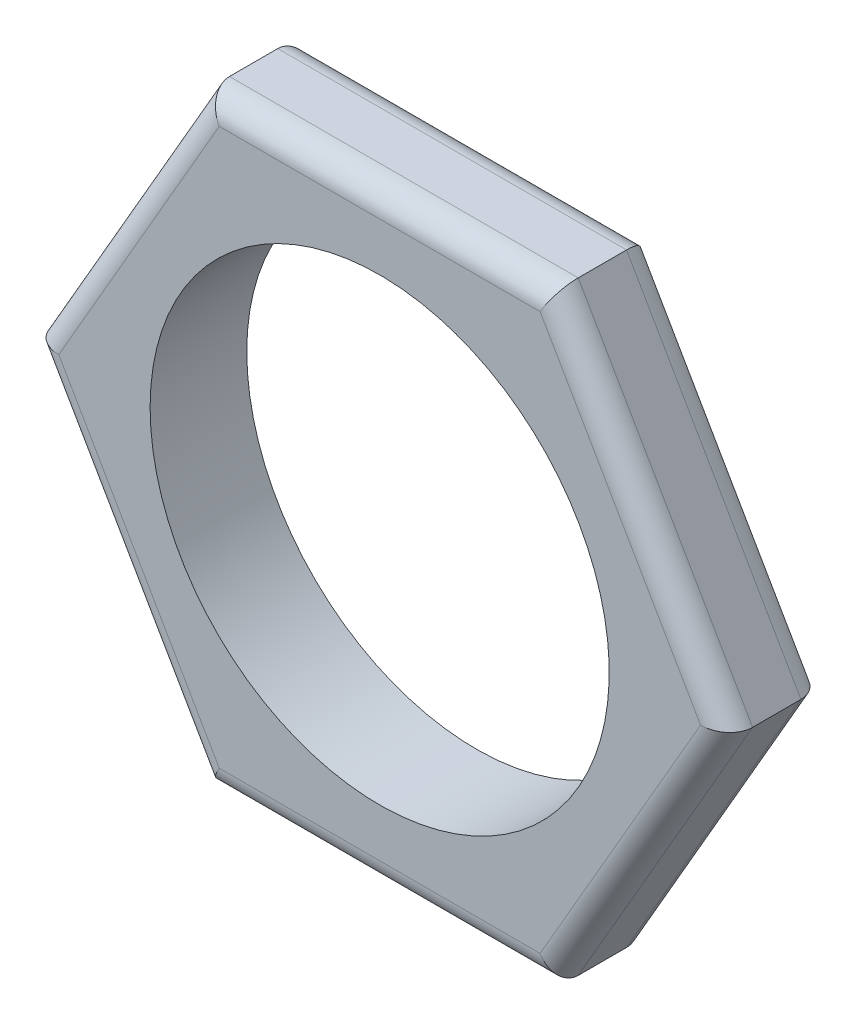
ISO-10303-21;
HEADER;
FILE_DESCRIPTION(('STEP AP214'),'2;1');
FILE_NAME('part.step','',(''),(''),'','','');
FILE_SCHEMA(('AUTOMOTIVE_DESIGN { 1 0 10303 214 1 1 1 1 }'));
ENDSEC;
DATA;
#1=APPLICATION_CONTEXT('core data for automotive mechanical design processes');
#2=APPLICATION_PROTOCOL_DEFINITION('international standard','automotive_design',2000,#1);
#3=PRODUCT_CONTEXT('',#1,'mechanical');
#4=PRODUCT('Part','Part','',(#3));
#5=PRODUCT_RELATED_PRODUCT_CATEGORY('part','',(#4));
#6=PRODUCT_DEFINITION_FORMATION('','',#4);
#7=PRODUCT_DEFINITION_CONTEXT('part definition',#1,'design');
#8=PRODUCT_DEFINITION('design','',#6,#7);
#9=PRODUCT_DEFINITION_SHAPE('','',#8);
#10=(LENGTH_UNIT() NAMED_UNIT(*) SI_UNIT(.MILLI.,.METRE.));
#11=(NAMED_UNIT(*) PLANE_ANGLE_UNIT() SI_UNIT($,.RADIAN.));
#12=(NAMED_UNIT(*) SI_UNIT($,.STERADIAN.) SOLID_ANGLE_UNIT());
#13=UNCERTAINTY_MEASURE_WITH_UNIT(LENGTH_MEASURE(1.E-05),#10,'distance_accuracy_value','');
#14=(GEOMETRIC_REPRESENTATION_CONTEXT(3) GLOBAL_UNCERTAINTY_ASSIGNED_CONTEXT((#13)) GLOBAL_UNIT_ASSIGNED_CONTEXT((#10,
#11,#12)) REPRESENTATION_CONTEXT('',''));
#15=CARTESIAN_POINT('',(0.,0.,0.));
#16=DIRECTION('',(0.,0.,1.));
#17=DIRECTION('',(1.,0.,0.));
#18=AXIS2_PLACEMENT_3D('',#15,#16,#17);
#19=CARTESIAN_POINT('',(-8.61550939198223,0.317499999999979,-0.635));
#20=DIRECTION('',(0.500000000000001,-0.866025403784438,0.));
#21=DIRECTION('',(0.866025403784438,0.500000000000001,0.));
#22=AXIS2_PLACEMENT_3D('',#19,#20,#21);
#23=CYLINDRICAL_SURFACE('',#22,0.635);
#24=CARTESIAN_POINT('',(-8.43220068151452,0.,-0.635));
#25=DIRECTION('',(0.,-1.,0.));
#26=DIRECTION('',(-1.,0.,0.));
#27=AXIS2_PLACEMENT_3D('',#24,#25,#26);
#28=ELLIPSE('',#27,0.733234841870825,0.635);
#29=CARTESIAN_POINT('',(-8.43220068151453,0.,-1.27));
#30=VERTEX_POINT('',#29);
#31=CARTESIAN_POINT('',(-9.16543552338535,0.,-0.635000000000001));
#32=VERTEX_POINT('',#31);
#33=EDGE_CURVE('E181',#30,#32,#28,.F.);
#34=ORIENTED_EDGE('',*,*,#33,.F.);
#35=DIRECTION('',(0.500000000000001,-0.866025403784438,0.));
#36=VECTOR('',#35,1.);
#37=CARTESIAN_POINT('',(-8.43220068151452,0.,-1.27));
#38=LINE('',#37,#36);
#39=CARTESIAN_POINT('',(-4.21610034075726,-7.30250000000004,-1.27));
#40=VERTEX_POINT('',#39);
#41=EDGE_CURVE('E109',#30,#40,#38,.T.);
#42=ORIENTED_EDGE('',*,*,#41,.T.);
#43=CARTESIAN_POINT('',(-4.21610034075726,-7.30250000000004,-0.635));
#44=DIRECTION('',(0.866025403784439,-0.499999999999999,0.));
#45=DIRECTION('',(0.499999999999999,0.866025403784439,0.));
#46=AXIS2_PLACEMENT_3D('',#43,#44,#45);
#47=ELLIPSE('',#46,0.733234841870825,0.635);
#48=CARTESIAN_POINT('',(-4.58271776169267,-7.93750000000004,-0.635));
#49=VERTEX_POINT('',#48);
#50=EDGE_CURVE('E21',#49,#40,#47,.T.);
#51=ORIENTED_EDGE('',*,*,#50,.F.);
#52=DIRECTION('',(-0.500000000000001,0.866025403784438,0.));
#53=VECTOR('',#52,1.);
#54=CARTESIAN_POINT('',(-9.16543552338535,0.,-0.635000000000001));
#55=LINE('',#54,#53);
#56=EDGE_CURVE('E106',#49,#32,#55,.T.);
#57=ORIENTED_EDGE('',*,*,#56,.T.);
#58=EDGE_LOOP('',(#34,#42,#51,#57));
#59=FACE_BOUND('',#58,.T.);
#60=ADVANCED_FACE('F18',(#59),#23,.T.);
#61=CARTESIAN_POINT('',(-4.58271776169267,-7.30250000000004,-0.635));
#62=DIRECTION('',(1.,0.,0.));
#63=DIRECTION('',(0.,0.,-1.));
#64=AXIS2_PLACEMENT_3D('',#61,#62,#63);
#65=CYLINDRICAL_SURFACE('',#64,0.635);
#66=CARTESIAN_POINT('',(4.21610034075723,-7.30250000000004,-0.635));
#67=DIRECTION('',(0.866025403784438,0.5,0.));
#68=DIRECTION('',(-0.5,0.866025403784438,0.));
#69=AXIS2_PLACEMENT_3D('',#66,#67,#68);
#70=ELLIPSE('',#69,0.733234841870825,0.635);
#71=CARTESIAN_POINT('',(4.58271776169264,-7.93750000000004,-0.635));
#72=VERTEX_POINT('',#71);
#73=CARTESIAN_POINT('',(4.21610034075723,-7.30250000000004,-1.27));
#74=VERTEX_POINT('',#73);
#75=EDGE_CURVE('E112',#72,#74,#70,.T.);
#76=ORIENTED_EDGE('',*,*,#75,.F.);
#77=DIRECTION('',(1.,0.,0.));
#78=VECTOR('',#77,1.);
#79=CARTESIAN_POINT('',(-4.58271776169267,-7.93750000000004,-0.635));
#80=LINE('',#79,#78);
#81=EDGE_CURVE('E114',#72,#49,#80,.F.);
#82=ORIENTED_EDGE('',*,*,#81,.T.);
#83=ORIENTED_EDGE('',*,*,#50,.T.);
#84=DIRECTION('',(1.,0.,0.));
#85=VECTOR('',#84,1.);
#86=CARTESIAN_POINT('',(0.,-7.30250000000004,-1.27));
#87=LINE('',#86,#85);
#88=EDGE_CURVE('E197',#40,#74,#87,.T.);
#89=ORIENTED_EDGE('',*,*,#88,.T.);
#90=EDGE_LOOP('',(#76,#82,#83,#89));
#91=FACE_BOUND('',#90,.T.);
#92=ADVANCED_FACE('F116',(#91),#65,.T.);
#93=CARTESIAN_POINT('',(4.03279163028952,-7.62000000000004,-0.635));
#94=DIRECTION('',(0.499999999999999,0.866025403784439,0.));
#95=DIRECTION('',(-0.866025403784439,0.499999999999999,0.));
#96=AXIS2_PLACEMENT_3D('',#93,#94,#95);
#97=CYLINDRICAL_SURFACE('',#96,0.635);
#98=CARTESIAN_POINT('',(8.43220068151448,0.,-0.635));
#99=DIRECTION('',(0.,1.,0.));
#100=DIRECTION('',(-1.,0.,0.));
#101=AXIS2_PLACEMENT_3D('',#98,#99,#100);
#102=ELLIPSE('',#101,0.733234841870824,0.635);
#103=CARTESIAN_POINT('',(9.16543552338531,0.,-0.635));
#104=VERTEX_POINT('',#103);
#105=CARTESIAN_POINT('',(8.43220068151448,0.,-1.27));
#106=VERTEX_POINT('',#105);
#107=EDGE_CURVE('E186',#104,#106,#102,.T.);
#108=ORIENTED_EDGE('',*,*,#107,.F.);
#109=DIRECTION('',(-0.499999999999999,-0.866025403784439,0.));
#110=VECTOR('',#109,1.);
#111=CARTESIAN_POINT('',(4.58271776169264,-7.93750000000004,-0.635000000000001));
#112=LINE('',#111,#110);
#113=EDGE_CURVE('E121',#104,#72,#112,.T.);
#114=ORIENTED_EDGE('',*,*,#113,.T.);
#115=ORIENTED_EDGE('',*,*,#75,.T.);
#116=DIRECTION('',(0.499999999999999,0.866025403784439,0.));
#117=VECTOR('',#116,1.);
#118=CARTESIAN_POINT('',(4.21610034075723,-7.30250000000004,-1.27));
#119=LINE('',#118,#117);
#120=EDGE_CURVE('E191',#74,#106,#119,.T.);
#121=ORIENTED_EDGE('',*,*,#120,.T.);
#122=EDGE_LOOP('',(#108,#114,#115,#121));
#123=FACE_BOUND('',#122,.T.);
#124=ADVANCED_FACE('F190',(#123),#97,.T.);
#125=CARTESIAN_POINT('',(8.61550939198219,-0.3175,-0.635));
#126=DIRECTION('',(-0.499999999999999,0.866025403784439,0.));
#127=DIRECTION('',(-0.866025403784439,-0.499999999999999,0.));
#128=AXIS2_PLACEMENT_3D('',#125,#126,#127);
#129=CYLINDRICAL_SURFACE('',#128,0.635);
#130=CARTESIAN_POINT('',(4.21610034075723,7.30250000000003,-0.635));
#131=DIRECTION('',(-0.866025403784438,0.5,0.));
#132=DIRECTION('',(-0.5,-0.866025403784438,0.));
#133=AXIS2_PLACEMENT_3D('',#130,#131,#132);
#134=ELLIPSE('',#133,0.733234841870825,0.635);
#135=CARTESIAN_POINT('',(4.58271776169264,7.93750000000003,-0.635));
#136=VERTEX_POINT('',#135);
#137=CARTESIAN_POINT('',(4.21610034075723,7.30250000000003,-1.27));
#138=VERTEX_POINT('',#137);
#139=EDGE_CURVE('E183',#136,#138,#134,.T.);
#140=ORIENTED_EDGE('',*,*,#139,.F.);
#141=DIRECTION('',(0.499999999999999,-0.866025403784439,0.));
#142=VECTOR('',#141,1.);
#143=CARTESIAN_POINT('',(9.16543552338531,0.,-0.635));
#144=LINE('',#143,#142);
#145=EDGE_CURVE('E149',#136,#104,#144,.T.);
#146=ORIENTED_EDGE('',*,*,#145,.T.);
#147=ORIENTED_EDGE('',*,*,#107,.T.);
#148=DIRECTION('',(-0.5,0.866025403784439,0.));
#149=VECTOR('',#148,1.);
#150=CARTESIAN_POINT('',(8.43220068151448,0.,-1.27));
#151=LINE('',#150,#149);
#152=EDGE_CURVE('E198',#106,#138,#151,.T.);
#153=ORIENTED_EDGE('',*,*,#152,.T.);
#154=EDGE_LOOP('',(#140,#146,#147,#153));
#155=FACE_BOUND('',#154,.T.);
#156=ADVANCED_FACE('F270',(#155),#129,.T.);
#157=CARTESIAN_POINT('',(4.58271776169264,7.30250000000003,-0.635));
#158=DIRECTION('',(-1.,0.,0.));
#159=DIRECTION('',(0.,0.,1.));
#160=AXIS2_PLACEMENT_3D('',#157,#158,#159);
#161=CYLINDRICAL_SURFACE('',#160,0.635);
#162=CARTESIAN_POINT('',(-4.21610034075725,7.30250000000003,-0.635));
#163=DIRECTION('',(-0.866025403784439,-0.5,0.));
#164=DIRECTION('',(0.5,-0.866025403784439,0.));
#165=AXIS2_PLACEMENT_3D('',#162,#163,#164);
#166=ELLIPSE('',#165,0.733234841870825,0.635);
#167=CARTESIAN_POINT('',(-4.58271776169266,7.93750000000003,-0.635));
#168=VERTEX_POINT('',#167);
#169=CARTESIAN_POINT('',(-4.21610034075725,7.30250000000003,-1.27));
#170=VERTEX_POINT('',#169);
#171=EDGE_CURVE('E122',#168,#170,#166,.T.);
#172=ORIENTED_EDGE('',*,*,#171,.F.);
#173=DIRECTION('',(1.,0.,0.));
#174=VECTOR('',#173,1.);
#175=CARTESIAN_POINT('',(4.58271776169264,7.93750000000003,-0.635));
#176=LINE('',#175,#174);
#177=EDGE_CURVE('E144',#168,#136,#176,.T.);
#178=ORIENTED_EDGE('',*,*,#177,.T.);
#179=ORIENTED_EDGE('',*,*,#139,.T.);
#180=DIRECTION('',(1.,0.,0.));
#181=VECTOR('',#180,1.);
#182=CARTESIAN_POINT('',(0.,7.30250000000003,-1.27));
#183=LINE('',#182,#181);
#184=EDGE_CURVE('E200',#138,#170,#183,.F.);
#185=ORIENTED_EDGE('',*,*,#184,.T.);
#186=EDGE_LOOP('',(#172,#178,#179,#185));
#187=FACE_BOUND('',#186,.T.);
#188=ADVANCED_FACE('F264',(#187),#161,.T.);
#189=CARTESIAN_POINT('',(-4.03279163028954,7.62000000000003,-0.635));
#190=DIRECTION('',(-0.5,-0.866025403784439,0.));
#191=DIRECTION('',(0.866025403784439,-0.5,0.));
#192=AXIS2_PLACEMENT_3D('',#189,#190,#191);
#193=CYLINDRICAL_SURFACE('',#192,0.635);
#194=ORIENTED_EDGE('',*,*,#171,.T.);
#195=DIRECTION('',(-0.5,-0.866025403784439,0.));
#196=VECTOR('',#195,1.);
#197=CARTESIAN_POINT('',(-4.21610034075725,7.30250000000003,-1.27));
#198=LINE('',#197,#196);
#199=EDGE_CURVE('E204',#170,#30,#198,.T.);
#200=ORIENTED_EDGE('',*,*,#199,.T.);
#201=ORIENTED_EDGE('',*,*,#33,.T.);
#202=DIRECTION('',(0.5,0.866025403784439,0.));
#203=VECTOR('',#202,1.);
#204=CARTESIAN_POINT('',(-4.58271776169266,7.93750000000003,-0.635));
#205=LINE('',#204,#203);
#206=EDGE_CURVE('E141',#32,#168,#205,.T.);
#207=ORIENTED_EDGE('',*,*,#206,.T.);
#208=EDGE_LOOP('',(#194,#200,#201,#207));
#209=FACE_BOUND('',#208,.T.);
#210=ADVANCED_FACE('F259',(#209),#193,.T.);
#211=CARTESIAN_POINT('',(-4.58271776169267,-7.93750000000004,1.27));
#212=DIRECTION('',(0.,1.,0.));
#213=DIRECTION('',(0.,0.,1.));
#214=AXIS2_PLACEMENT_3D('',#211,#212,#213);
#215=PLANE('',#214);
#216=ORIENTED_EDGE('',*,*,#81,.F.);
#217=DIRECTION('',(0.,0.,1.));
#218=VECTOR('',#217,1.);
#219=CARTESIAN_POINT('',(4.58271776169264,-7.93750000000004,1.27));
#220=LINE('',#219,#218);
#221=CARTESIAN_POINT('',(4.58271776169264,-7.93750000000004,0.635));
#222=VERTEX_POINT('',#221);
#223=EDGE_CURVE('E152',#72,#222,#220,.T.);
#224=ORIENTED_EDGE('',*,*,#223,.T.);
#225=DIRECTION('',(-1.,0.,0.));
#226=VECTOR('',#225,1.);
#227=CARTESIAN_POINT('',(0.,-7.93750000000004,0.635));
#228=LINE('',#227,#226);
#229=CARTESIAN_POINT('',(-4.58271776169267,-7.93750000000004,0.635));
#230=VERTEX_POINT('',#229);
#231=EDGE_CURVE('E129',#230,#222,#228,.F.);
#232=ORIENTED_EDGE('',*,*,#231,.F.);
#233=DIRECTION('',(0.,0.,1.));
#234=VECTOR('',#233,1.);
#235=CARTESIAN_POINT('',(-4.58271776169267,-7.93750000000004,1.27));
#236=LINE('',#235,#234);
#237=EDGE_CURVE('E126',#230,#49,#236,.F.);
#238=ORIENTED_EDGE('',*,*,#237,.T.);
#239=EDGE_LOOP('',(#216,#224,#232,#238));
#240=FACE_BOUND('',#239,.T.);
#241=ADVANCED_FACE('F127',(#240),#215,.F.);
#242=CARTESIAN_POINT('',(4.58271776169264,-7.93750000000004,1.27));
#243=DIRECTION('',(-0.866025403784439,0.499999999999999,0.));
#244=DIRECTION('',(-0.499999999999999,-0.866025403784439,0.));
#245=AXIS2_PLACEMENT_3D('',#242,#243,#244);
#246=PLANE('',#245);
#247=ORIENTED_EDGE('',*,*,#113,.F.);
#248=DIRECTION('',(0.,0.,1.));
#249=VECTOR('',#248,1.);
#250=CARTESIAN_POINT('',(9.16543552338531,0.,1.27));
#251=LINE('',#250,#249);
#252=CARTESIAN_POINT('',(9.16543552338531,0.,0.635));
#253=VERTEX_POINT('',#252);
#254=EDGE_CURVE('E148',#104,#253,#251,.T.);
#255=ORIENTED_EDGE('',*,*,#254,.T.);
#256=DIRECTION('',(-0.499999999999999,-0.866025403784439,0.));
#257=VECTOR('',#256,1.);
#258=CARTESIAN_POINT('',(6.87407664253899,-3.96874999999999,0.635));
#259=LINE('',#258,#257);
#260=EDGE_CURVE('E175',#222,#253,#259,.F.);
#261=ORIENTED_EDGE('',*,*,#260,.F.);
#262=ORIENTED_EDGE('',*,*,#223,.F.);
#263=EDGE_LOOP('',(#247,#255,#261,#262));
#264=FACE_BOUND('',#263,.T.);
#265=ADVANCED_FACE('F272',(#264),#246,.F.);
#266=CARTESIAN_POINT('',(9.16543552338531,0.,1.27));
#267=DIRECTION('',(-0.866025403784439,-0.499999999999999,0.));
#268=DIRECTION('',(0.499999999999999,-0.866025403784439,0.));
#269=AXIS2_PLACEMENT_3D('',#266,#267,#268);
#270=PLANE('',#269);
#271=ORIENTED_EDGE('',*,*,#145,.F.);
#272=DIRECTION('',(0.,0.,-1.));
#273=VECTOR('',#272,1.);
#274=CARTESIAN_POINT('',(4.58271776169264,7.93750000000003,1.27));
#275=LINE('',#274,#273);
#276=CARTESIAN_POINT('',(4.58271776169264,7.93750000000003,0.635));
#277=VERTEX_POINT('',#276);
#278=EDGE_CURVE('E147',#136,#277,#275,.F.);
#279=ORIENTED_EDGE('',*,*,#278,.T.);
#280=DIRECTION('',(0.499999999999999,-0.866025403784439,0.));
#281=VECTOR('',#280,1.);
#282=CARTESIAN_POINT('',(6.87407664253899,3.96875,0.635));
#283=LINE('',#282,#281);
#284=EDGE_CURVE('E171',#253,#277,#283,.F.);
#285=ORIENTED_EDGE('',*,*,#284,.F.);
#286=ORIENTED_EDGE('',*,*,#254,.F.);
#287=EDGE_LOOP('',(#271,#279,#285,#286));
#288=FACE_BOUND('',#287,.T.);
#289=ADVANCED_FACE('F267',(#288),#270,.F.);
#290=CARTESIAN_POINT('',(4.58271776169264,7.93750000000003,1.27));
#291=DIRECTION('',(0.,-1.,0.));
#292=DIRECTION('',(0.,0.,-1.));
#293=AXIS2_PLACEMENT_3D('',#290,#291,#292);
#294=PLANE('',#293);
#295=ORIENTED_EDGE('',*,*,#177,.F.);
#296=DIRECTION('',(0.,0.,1.));
#297=VECTOR('',#296,1.);
#298=CARTESIAN_POINT('',(-4.58271776169266,7.93750000000003,1.27));
#299=LINE('',#298,#297);
#300=CARTESIAN_POINT('',(-4.58271776169266,7.93750000000003,0.635));
#301=VERTEX_POINT('',#300);
#302=EDGE_CURVE('E133',#168,#301,#299,.T.);
#303=ORIENTED_EDGE('',*,*,#302,.T.);
#304=DIRECTION('',(1.,0.,0.));
#305=VECTOR('',#304,1.);
#306=CARTESIAN_POINT('',(0.,7.93750000000003,0.635));
#307=LINE('',#306,#305);
#308=EDGE_CURVE('E167',#277,#301,#307,.F.);
#309=ORIENTED_EDGE('',*,*,#308,.F.);
#310=ORIENTED_EDGE('',*,*,#278,.F.);
#311=EDGE_LOOP('',(#295,#303,#309,#310));
#312=FACE_BOUND('',#311,.T.);
#313=ADVANCED_FACE('F261',(#312),#294,.F.);
#314=CARTESIAN_POINT('',(-4.58271776169266,7.93750000000003,1.27));
#315=DIRECTION('',(0.866025403784439,-0.5,0.));
#316=DIRECTION('',(0.5,0.866025403784439,0.));
#317=AXIS2_PLACEMENT_3D('',#314,#315,#316);
#318=PLANE('',#317);
#319=ORIENTED_EDGE('',*,*,#206,.F.);
#320=DIRECTION('',(0.,0.,1.));
#321=VECTOR('',#320,1.);
#322=CARTESIAN_POINT('',(-9.16543552338535,0.,1.27));
#323=LINE('',#322,#321);
#324=CARTESIAN_POINT('',(-9.16543552338535,0.,0.635));
#325=VERTEX_POINT('',#324);
#326=EDGE_CURVE('E137',#32,#325,#323,.T.);
#327=ORIENTED_EDGE('',*,*,#326,.T.);
#328=DIRECTION('',(0.5,0.866025403784439,0.));
#329=VECTOR('',#328,1.);
#330=CARTESIAN_POINT('',(-6.874076642539,3.96875000000001,0.635));
#331=LINE('',#330,#329);
#332=EDGE_CURVE('E163',#301,#325,#331,.F.);
#333=ORIENTED_EDGE('',*,*,#332,.F.);
#334=ORIENTED_EDGE('',*,*,#302,.F.);
#335=EDGE_LOOP('',(#319,#327,#333,#334));
#336=FACE_BOUND('',#335,.T.);
#337=ADVANCED_FACE('F255',(#336),#318,.F.);
#338=CARTESIAN_POINT('',(-9.16543552338535,0.,1.27));
#339=DIRECTION('',(0.866025403784438,0.500000000000001,0.));
#340=DIRECTION('',(-0.500000000000001,0.866025403784438,0.));
#341=AXIS2_PLACEMENT_3D('',#338,#339,#340);
#342=PLANE('',#341);
#343=ORIENTED_EDGE('',*,*,#56,.F.);
#344=ORIENTED_EDGE('',*,*,#237,.F.);
#345=DIRECTION('',(-0.500000000000001,0.866025403784438,0.));
#346=VECTOR('',#345,1.);
#347=CARTESIAN_POINT('',(-6.87407664253901,-3.96875000000003,0.635));
#348=LINE('',#347,#346);
#349=EDGE_CURVE('E161',#325,#230,#348,.F.);
#350=ORIENTED_EDGE('',*,*,#349,.F.);
#351=ORIENTED_EDGE('',*,*,#326,.F.);
#352=EDGE_LOOP('',(#343,#344,#350,#351));
#353=FACE_BOUND('',#352,.T.);
#354=ADVANCED_FACE('F136',(#353),#342,.F.);
#355=CARTESIAN_POINT('',(0.,0.,-1.27));
#356=DIRECTION('',(0.,0.,1.));
#357=DIRECTION('',(1.,0.,0.));
#358=AXIS2_PLACEMENT_3D('',#355,#356,#357);
#359=PLANE('',#358);
#360=CARTESIAN_POINT('',(0.,0.,-1.27));
#361=DIRECTION('',(0.,0.,-1.));
#362=DIRECTION('',(-1.,0.,0.));
#363=AXIS2_PLACEMENT_3D('',#360,#361,#362);
#364=CIRCLE('',#363,6.0325);
#365=CARTESIAN_POINT('',(-6.0325,0.,-1.27));
#366=VERTEX_POINT('',#365);
#367=EDGE_CURVE('E154',#366,#366,#364,.F.);
#368=ORIENTED_EDGE('',*,*,#367,.T.);
#369=EDGE_LOOP('',(#368));
#370=FACE_BOUND('',#369,.T.);
#371=ORIENTED_EDGE('',*,*,#184,.F.);
#372=ORIENTED_EDGE('',*,*,#152,.F.);
#373=ORIENTED_EDGE('',*,*,#120,.F.);
#374=ORIENTED_EDGE('',*,*,#88,.F.);
#375=ORIENTED_EDGE('',*,*,#41,.F.);
#376=ORIENTED_EDGE('',*,*,#199,.F.);
#377=EDGE_LOOP('',(#371,#372,#373,#374,#375,#376));
#378=FACE_BOUND('',#377,.T.);
#379=ADVANCED_FACE('F196',(#370,#378),#359,.F.);
#380=CARTESIAN_POINT('',(0.,-7.30250000000004,0.635));
#381=DIRECTION('',(-1.,0.,0.));
#382=DIRECTION('',(0.,0.,1.));
#383=AXIS2_PLACEMENT_3D('',#380,#381,#382);
#384=CYLINDRICAL_SURFACE('',#383,0.635);
#385=CARTESIAN_POINT('',(4.21610034075723,-7.30250000000004,0.635));
#386=DIRECTION('',(-0.866025403784438,-0.5,0.));
#387=DIRECTION('',(0.5,-0.866025403784438,0.));
#388=AXIS2_PLACEMENT_3D('',#385,#386,#387);
#389=ELLIPSE('',#388,0.733234841870825,0.635);
#390=CARTESIAN_POINT('',(4.21610034075723,-7.30250000000004,1.27));
#391=VERTEX_POINT('',#390);
#392=EDGE_CURVE('E176',#391,#222,#389,.F.);
#393=ORIENTED_EDGE('',*,*,#392,.F.);
#394=DIRECTION('',(1.,0.,0.));
#395=VECTOR('',#394,1.);
#396=CARTESIAN_POINT('',(0.,-7.30250000000004,1.27));
#397=LINE('',#396,#395);
#398=CARTESIAN_POINT('',(-4.21610034075725,-7.30250000000004,1.27));
#399=VERTEX_POINT('',#398);
#400=EDGE_CURVE('E157',#399,#391,#397,.T.);
#401=ORIENTED_EDGE('',*,*,#400,.F.);
#402=CARTESIAN_POINT('',(-4.21610034075725,-7.30250000000004,0.635));
#403=DIRECTION('',(-0.866025403784439,0.499999999999999,0.));
#404=DIRECTION('',(0.499999999999999,0.866025403784439,0.));
#405=AXIS2_PLACEMENT_3D('',#402,#403,#404);
#406=ELLIPSE('',#405,0.733234841870825,0.635);
#407=EDGE_CURVE('E158',#230,#399,#406,.T.);
#408=ORIENTED_EDGE('',*,*,#407,.F.);
#409=ORIENTED_EDGE('',*,*,#231,.T.);
#410=EDGE_LOOP('',(#393,#401,#408,#409));
#411=FACE_BOUND('',#410,.T.);
#412=ADVANCED_FACE('F241',(#411),#384,.T.);
#413=CARTESIAN_POINT('',(6.32415051113587,-3.65124999999999,0.635));
#414=DIRECTION('',(-0.499999999999999,-0.866025403784439,0.));
#415=DIRECTION('',(0.866025403784439,-0.499999999999999,0.));
#416=AXIS2_PLACEMENT_3D('',#413,#414,#415);
#417=CYLINDRICAL_SURFACE('',#416,0.635);
#418=CARTESIAN_POINT('',(8.43220068151448,0.,0.635));
#419=DIRECTION('',(0.,-1.,0.));
#420=DIRECTION('',(1.,0.,0.));
#421=AXIS2_PLACEMENT_3D('',#418,#419,#420);
#422=ELLIPSE('',#421,0.733234841870825,0.635);
#423=CARTESIAN_POINT('',(8.43220068151448,0.,1.27));
#424=VERTEX_POINT('',#423);
#425=EDGE_CURVE('E172',#424,#253,#422,.F.);
#426=ORIENTED_EDGE('',*,*,#425,.F.);
#427=DIRECTION('',(0.499999999999999,0.866025403784439,0.));
#428=VECTOR('',#427,1.);
#429=CARTESIAN_POINT('',(4.21610034075723,-7.30250000000004,1.27));
#430=LINE('',#429,#428);
#431=EDGE_CURVE('E215',#391,#424,#430,.T.);
#432=ORIENTED_EDGE('',*,*,#431,.F.);
#433=ORIENTED_EDGE('',*,*,#392,.T.);
#434=ORIENTED_EDGE('',*,*,#260,.T.);
#435=EDGE_LOOP('',(#426,#432,#433,#434));
#436=FACE_BOUND('',#435,.T.);
#437=ADVANCED_FACE('F275',(#436),#417,.T.);
#438=CARTESIAN_POINT('',(6.32415051113587,3.65125,0.635));
#439=DIRECTION('',(0.499999999999999,-0.866025403784439,0.));
#440=DIRECTION('',(0.866025403784439,0.499999999999999,0.));
#441=AXIS2_PLACEMENT_3D('',#438,#439,#440);
#442=CYLINDRICAL_SURFACE('',#441,0.635);
#443=ORIENTED_EDGE('',*,*,#425,.T.);
#444=ORIENTED_EDGE('',*,*,#284,.T.);
#445=CARTESIAN_POINT('',(4.21610034075723,7.30250000000003,0.635));
#446=DIRECTION('',(0.866025403784438,-0.5,0.));
#447=DIRECTION('',(0.5,0.866025403784438,0.));
#448=AXIS2_PLACEMENT_3D('',#445,#446,#447);
#449=ELLIPSE('',#448,0.733234841870825,0.635);
#450=CARTESIAN_POINT('',(4.21610034075723,7.30250000000004,1.27));
#451=VERTEX_POINT('',#450);
#452=EDGE_CURVE('E168',#451,#277,#449,.F.);
#453=ORIENTED_EDGE('',*,*,#452,.F.);
#454=DIRECTION('',(-0.499999999999999,0.866025403784439,0.));
#455=VECTOR('',#454,1.);
#456=CARTESIAN_POINT('',(8.43220068151448,0.,1.27));
#457=LINE('',#456,#455);
#458=EDGE_CURVE('E218',#424,#451,#457,.T.);
#459=ORIENTED_EDGE('',*,*,#458,.F.);
#460=EDGE_LOOP('',(#443,#444,#453,#459));
#461=FACE_BOUND('',#460,.T.);
#462=ADVANCED_FACE('F278',(#461),#442,.T.);
#463=CARTESIAN_POINT('',(0.,7.30250000000003,0.635));
#464=DIRECTION('',(1.,0.,0.));
#465=DIRECTION('',(0.,0.,-1.));
#466=AXIS2_PLACEMENT_3D('',#463,#464,#465);
#467=CYLINDRICAL_SURFACE('',#466,0.635);
#468=ORIENTED_EDGE('',*,*,#452,.T.);
#469=ORIENTED_EDGE('',*,*,#308,.T.);
#470=CARTESIAN_POINT('',(-4.21610034075725,7.30250000000003,0.635));
#471=DIRECTION('',(0.866025403784439,0.5,0.));
#472=DIRECTION('',(-0.5,0.866025403784439,0.));
#473=AXIS2_PLACEMENT_3D('',#470,#471,#472);
#474=ELLIPSE('',#473,0.733234841870825,0.635);
#475=CARTESIAN_POINT('',(-4.21610034075725,7.30250000000003,1.27));
#476=VERTEX_POINT('',#475);
#477=EDGE_CURVE('E164',#476,#301,#474,.F.);
#478=ORIENTED_EDGE('',*,*,#477,.F.);
#479=DIRECTION('',(1.,0.,0.));
#480=VECTOR('',#479,1.);
#481=CARTESIAN_POINT('',(0.,7.30250000000003,1.27));
#482=LINE('',#481,#480);
#483=EDGE_CURVE('E223',#451,#476,#482,.F.);
#484=ORIENTED_EDGE('',*,*,#483,.F.);
#485=EDGE_LOOP('',(#468,#469,#478,#484));
#486=FACE_BOUND('',#485,.T.);
#487=ADVANCED_FACE('F249',(#486),#467,.T.);
#488=CARTESIAN_POINT('',(-6.32415051113588,3.65125000000001,0.635));
#489=DIRECTION('',(0.5,0.866025403784439,0.));
#490=DIRECTION('',(-0.866025403784439,0.5,0.));
#491=AXIS2_PLACEMENT_3D('',#488,#489,#490);
#492=CYLINDRICAL_SURFACE('',#491,0.635);
#493=CARTESIAN_POINT('',(-8.43220068151452,0.,0.635));
#494=DIRECTION('',(0.,1.,0.));
#495=DIRECTION('',(-1.,0.,0.));
#496=AXIS2_PLACEMENT_3D('',#493,#494,#495);
#497=ELLIPSE('',#496,0.733234841870825,0.635);
#498=CARTESIAN_POINT('',(-8.43220068151453,0.,1.27));
#499=VERTEX_POINT('',#498);
#500=EDGE_CURVE('E36',#499,#325,#497,.F.);
#501=ORIENTED_EDGE('',*,*,#500,.F.);
#502=DIRECTION('',(-0.5,-0.866025403784438,0.));
#503=VECTOR('',#502,1.);
#504=CARTESIAN_POINT('',(-4.21610034075725,7.30250000000003,1.27));
#505=LINE('',#504,#503);
#506=EDGE_CURVE('E228',#476,#499,#505,.T.);
#507=ORIENTED_EDGE('',*,*,#506,.F.);
#508=ORIENTED_EDGE('',*,*,#477,.T.);
#509=ORIENTED_EDGE('',*,*,#332,.T.);
#510=EDGE_LOOP('',(#501,#507,#508,#509));
#511=FACE_BOUND('',#510,.T.);
#512=ADVANCED_FACE('F246',(#511),#492,.T.);
#513=CARTESIAN_POINT('',(-6.32415051113589,-3.65125000000003,0.635));
#514=DIRECTION('',(-0.500000000000001,0.866025403784438,0.));
#515=DIRECTION('',(-0.866025403784438,-0.500000000000001,0.));
#516=AXIS2_PLACEMENT_3D('',#513,#514,#515);
#517=CYLINDRICAL_SURFACE('',#516,0.635);
#518=ORIENTED_EDGE('',*,*,#407,.T.);
#519=DIRECTION('',(0.500000000000001,-0.866025403784438,0.));
#520=VECTOR('',#519,1.);
#521=CARTESIAN_POINT('',(-8.43220068151452,0.,1.27));
#522=LINE('',#521,#520);
#523=EDGE_CURVE('E27',#499,#399,#522,.T.);
#524=ORIENTED_EDGE('',*,*,#523,.F.);
#525=ORIENTED_EDGE('',*,*,#500,.T.);
#526=ORIENTED_EDGE('',*,*,#349,.T.);
#527=EDGE_LOOP('',(#518,#524,#525,#526));
#528=FACE_BOUND('',#527,.T.);
#529=ADVANCED_FACE('F238',(#528),#517,.T.);
#530=CARTESIAN_POINT('',(0.,0.,1.27));
#531=DIRECTION('',(0.,0.,-1.));
#532=DIRECTION('',(-1.,0.,0.));
#533=AXIS2_PLACEMENT_3D('',#530,#531,#532);
#534=CYLINDRICAL_SURFACE('',#533,6.0325);
#535=CARTESIAN_POINT('',(0.,0.,1.27));
#536=DIRECTION('',(0.,0.,-1.));
#537=DIRECTION('',(-1.,0.,0.));
#538=AXIS2_PLACEMENT_3D('',#535,#536,#537);
#539=CIRCLE('',#538,6.0325);
#540=CARTESIAN_POINT('',(-6.0325,0.,1.27));
#541=VERTEX_POINT('',#540);
#542=EDGE_CURVE('E11',#541,#541,#539,.T.);
#543=ORIENTED_EDGE('',*,*,#542,.F.);
#544=EDGE_LOOP('',(#543));
#545=FACE_BOUND('',#544,.T.);
#546=ORIENTED_EDGE('',*,*,#367,.F.);
#547=EDGE_LOOP('',(#546));
#548=FACE_BOUND('',#547,.T.);
#549=ADVANCED_FACE('F289',(#545,#548),#534,.F.);
#550=CARTESIAN_POINT('',(0.,0.,1.27));
#551=DIRECTION('',(0.,0.,1.));
#552=DIRECTION('',(1.,0.,0.));
#553=AXIS2_PLACEMENT_3D('',#550,#551,#552);
#554=PLANE('',#553);
#555=ORIENTED_EDGE('',*,*,#542,.T.);
#556=EDGE_LOOP('',(#555));
#557=FACE_BOUND('',#556,.T.);
#558=ORIENTED_EDGE('',*,*,#506,.T.);
#559=ORIENTED_EDGE('',*,*,#523,.T.);
#560=ORIENTED_EDGE('',*,*,#400,.T.);
#561=ORIENTED_EDGE('',*,*,#431,.T.);
#562=ORIENTED_EDGE('',*,*,#458,.T.);
#563=ORIENTED_EDGE('',*,*,#483,.T.);
#564=EDGE_LOOP('',(#558,#559,#560,#561,#562,#563));
#565=FACE_BOUND('',#564,.T.);
#566=ADVANCED_FACE('F244',(#557,#565),#554,.T.);
#567=CLOSED_SHELL('',(#60,#92,#124,#156,#188,#210,#241,#265,#289,#313,#337,#354,#379,#412,#437,
#462,#487,#512,#529,#549,#566));
#568=MANIFOLD_SOLID_BREP('B1',#567);
#569=ADVANCED_BREP_SHAPE_REPRESENTATION('',(#18,#568),#14);
#570=SHAPE_DEFINITION_REPRESENTATION(#9,#569);
ENDSEC;
END-ISO-10303-21;
